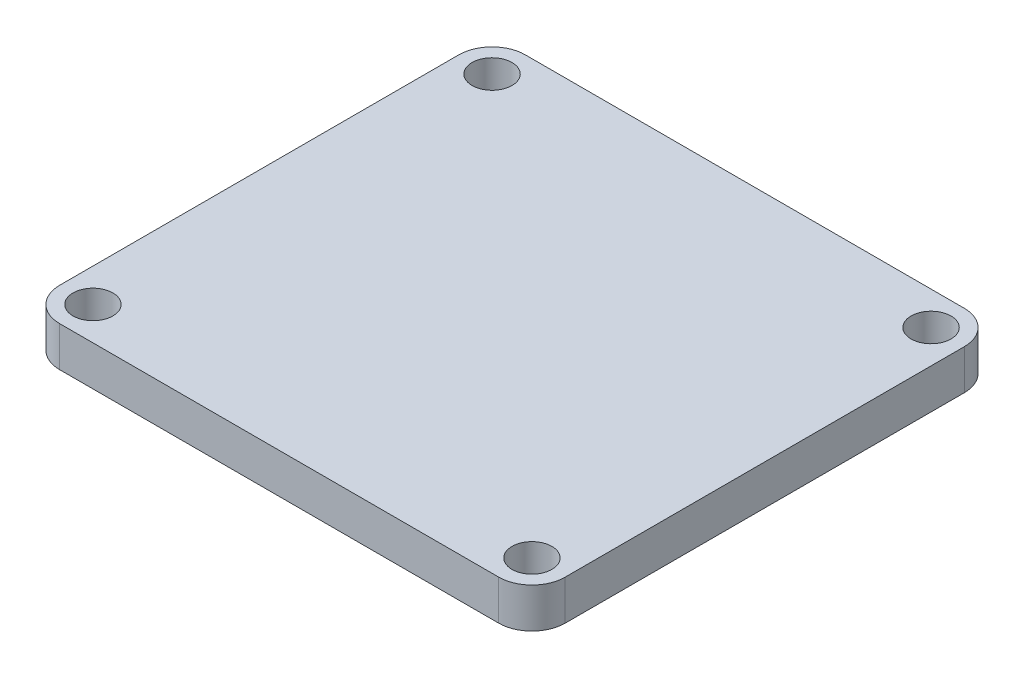
ISO-10303-21;
HEADER;
FILE_DESCRIPTION(('STEP AP214'),'2;1');
FILE_NAME('part.step','',(''),(''),'','','');
FILE_SCHEMA(('AUTOMOTIVE_DESIGN { 1 0 10303 214 1 1 1 1 }'));
ENDSEC;
DATA;
#1=APPLICATION_CONTEXT('core data for automotive mechanical design processes');
#2=APPLICATION_PROTOCOL_DEFINITION('international standard','automotive_design',2000,#1);
#3=PRODUCT_CONTEXT('',#1,'mechanical');
#4=PRODUCT('Part','Part','',(#3));
#5=PRODUCT_RELATED_PRODUCT_CATEGORY('part','',(#4));
#6=PRODUCT_DEFINITION_FORMATION('','',#4);
#7=PRODUCT_DEFINITION_CONTEXT('part definition',#1,'design');
#8=PRODUCT_DEFINITION('design','',#6,#7);
#9=PRODUCT_DEFINITION_SHAPE('','',#8);
#10=(LENGTH_UNIT() NAMED_UNIT(*) SI_UNIT(.MILLI.,.METRE.));
#11=(NAMED_UNIT(*) PLANE_ANGLE_UNIT() SI_UNIT($,.RADIAN.));
#12=(NAMED_UNIT(*) SI_UNIT($,.STERADIAN.) SOLID_ANGLE_UNIT());
#13=UNCERTAINTY_MEASURE_WITH_UNIT(LENGTH_MEASURE(1.E-05),#10,'distance_accuracy_value','');
#14=(GEOMETRIC_REPRESENTATION_CONTEXT(3) GLOBAL_UNCERTAINTY_ASSIGNED_CONTEXT((#13)) GLOBAL_UNIT_ASSIGNED_CONTEXT((#10,
#11,#12)) REPRESENTATION_CONTEXT('',''));
#15=CARTESIAN_POINT('',(0.,0.,0.));
#16=DIRECTION('',(0.,0.,1.));
#17=DIRECTION('',(1.,0.,0.));
#18=AXIS2_PLACEMENT_3D('',#15,#16,#17);
#19=CARTESIAN_POINT('',(-33.,6.,30.));
#20=DIRECTION('',(0.,-1.,0.));
#21=DIRECTION('',(0.,0.,-1.));
#22=AXIS2_PLACEMENT_3D('',#19,#20,#21);
#23=PLANE('',#22);
#24=CARTESIAN_POINT('',(-33.,6.,30.));
#25=DIRECTION('',(0.,1.,0.));
#26=DIRECTION('',(0.,0.,-1.));
#27=AXIS2_PLACEMENT_3D('',#24,#25,#26);
#28=CIRCLE('',#27,5.);
#29=CARTESIAN_POINT('',(-38.,6.,30.));
#30=VERTEX_POINT('',#29);
#31=CARTESIAN_POINT('',(-33.,6.,35.));
#32=VERTEX_POINT('',#31);
#33=EDGE_CURVE('E147',#30,#32,#28,.T.);
#34=ORIENTED_EDGE('',*,*,#33,.T.);
#35=DIRECTION('',(1.,0.,0.));
#36=VECTOR('',#35,1.);
#37=CARTESIAN_POINT('',(-33.,6.,35.));
#38=LINE('',#37,#36);
#39=CARTESIAN_POINT('',(33.,6.,35.));
#40=VERTEX_POINT('',#39);
#41=EDGE_CURVE('E95',#32,#40,#38,.T.);
#42=ORIENTED_EDGE('',*,*,#41,.T.);
#43=CARTESIAN_POINT('',(33.,6.,30.));
#44=DIRECTION('',(0.,1.,0.));
#45=DIRECTION('',(0.,0.,1.));
#46=AXIS2_PLACEMENT_3D('',#43,#44,#45);
#47=CIRCLE('',#46,5.);
#48=CARTESIAN_POINT('',(38.,6.,30.));
#49=VERTEX_POINT('',#48);
#50=EDGE_CURVE('E162',#40,#49,#47,.T.);
#51=ORIENTED_EDGE('',*,*,#50,.T.);
#52=DIRECTION('',(0.,0.,-1.));
#53=VECTOR('',#52,1.);
#54=CARTESIAN_POINT('',(38.,6.,30.));
#55=LINE('',#54,#53);
#56=CARTESIAN_POINT('',(38.,6.,-30.));
#57=VERTEX_POINT('',#56);
#58=EDGE_CURVE('E175',#49,#57,#55,.T.);
#59=ORIENTED_EDGE('',*,*,#58,.T.);
#60=CARTESIAN_POINT('',(33.,6.,-30.));
#61=DIRECTION('',(0.,1.,0.));
#62=DIRECTION('',(0.,0.,-1.));
#63=AXIS2_PLACEMENT_3D('',#60,#61,#62);
#64=CIRCLE('',#63,5.);
#65=CARTESIAN_POINT('',(33.,6.,-35.));
#66=VERTEX_POINT('',#65);
#67=EDGE_CURVE('E114',#57,#66,#64,.T.);
#68=ORIENTED_EDGE('',*,*,#67,.T.);
#69=DIRECTION('',(-1.,0.,0.));
#70=VECTOR('',#69,1.);
#71=CARTESIAN_POINT('',(-33.,6.,-35.));
#72=LINE('',#71,#70);
#73=CARTESIAN_POINT('',(-33.,6.,-35.));
#74=VERTEX_POINT('',#73);
#75=EDGE_CURVE('E108',#66,#74,#72,.T.);
#76=ORIENTED_EDGE('',*,*,#75,.T.);
#77=CARTESIAN_POINT('',(-33.,6.,-30.));
#78=DIRECTION('',(0.,1.,0.));
#79=DIRECTION('',(0.,0.,-1.));
#80=AXIS2_PLACEMENT_3D('',#77,#78,#79);
#81=CIRCLE('',#80,5.00000000000001);
#82=CARTESIAN_POINT('',(-38.,6.,-30.));
#83=VERTEX_POINT('',#82);
#84=EDGE_CURVE('E112',#74,#83,#81,.T.);
#85=ORIENTED_EDGE('',*,*,#84,.T.);
#86=DIRECTION('',(0.,0.,1.));
#87=VECTOR('',#86,1.);
#88=CARTESIAN_POINT('',(-38.,6.,30.));
#89=LINE('',#88,#87);
#90=EDGE_CURVE('E52',#83,#30,#89,.T.);
#91=ORIENTED_EDGE('',*,*,#90,.T.);
#92=EDGE_LOOP('',(#34,#42,#51,#59,#68,#76,#85,#91));
#93=FACE_BOUND('',#92,.T.);
#94=CARTESIAN_POINT('',(-33.,6.,-30.));
#95=DIRECTION('',(0.,1.,0.));
#96=DIRECTION('',(0.,0.,1.));
#97=AXIS2_PLACEMENT_3D('',#94,#95,#96);
#98=CIRCLE('',#97,3.00000000000001);
#99=CARTESIAN_POINT('',(-33.,6.,-27.));
#100=VERTEX_POINT('',#99);
#101=EDGE_CURVE('E136',#100,#100,#98,.T.);
#102=ORIENTED_EDGE('',*,*,#101,.F.);
#103=EDGE_LOOP('',(#102));
#104=FACE_BOUND('',#103,.T.);
#105=CARTESIAN_POINT('',(-33.,6.,30.));
#106=DIRECTION('',(0.,1.,0.));
#107=DIRECTION('',(0.,0.,1.));
#108=AXIS2_PLACEMENT_3D('',#105,#106,#107);
#109=CIRCLE('',#108,3.00000000000001);
#110=CARTESIAN_POINT('',(-33.,6.,33.));
#111=VERTEX_POINT('',#110);
#112=EDGE_CURVE('E184',#111,#111,#109,.T.);
#113=ORIENTED_EDGE('',*,*,#112,.F.);
#114=EDGE_LOOP('',(#113));
#115=FACE_BOUND('',#114,.T.);
#116=CARTESIAN_POINT('',(33.,6.,-30.));
#117=DIRECTION('',(0.,1.,0.));
#118=DIRECTION('',(0.,0.,1.));
#119=AXIS2_PLACEMENT_3D('',#116,#117,#118);
#120=CIRCLE('',#119,3.00000000000001);
#121=CARTESIAN_POINT('',(33.,6.,-27.));
#122=VERTEX_POINT('',#121);
#123=EDGE_CURVE('E190',#122,#122,#120,.T.);
#124=ORIENTED_EDGE('',*,*,#123,.F.);
#125=EDGE_LOOP('',(#124));
#126=FACE_BOUND('',#125,.T.);
#127=CARTESIAN_POINT('',(33.,6.,30.));
#128=DIRECTION('',(0.,1.,0.));
#129=DIRECTION('',(0.,0.,1.));
#130=AXIS2_PLACEMENT_3D('',#127,#128,#129);
#131=CIRCLE('',#130,3.00000000000001);
#132=CARTESIAN_POINT('',(33.,6.,33.));
#133=VERTEX_POINT('',#132);
#134=EDGE_CURVE('E196',#133,#133,#131,.T.);
#135=ORIENTED_EDGE('',*,*,#134,.F.);
#136=EDGE_LOOP('',(#135));
#137=FACE_BOUND('',#136,.T.);
#138=ADVANCED_FACE('F35',(#93,#104,#115,#126,#137),#23,.F.);
#139=CARTESIAN_POINT('',(-33.,0.,30.));
#140=DIRECTION('',(0.,-1.,0.));
#141=DIRECTION('',(0.,0.,-1.));
#142=AXIS2_PLACEMENT_3D('',#139,#140,#141);
#143=PLANE('',#142);
#144=CARTESIAN_POINT('',(33.,0.,-30.));
#145=DIRECTION('',(0.,1.,0.));
#146=DIRECTION('',(0.,0.,1.));
#147=AXIS2_PLACEMENT_3D('',#144,#145,#146);
#148=CIRCLE('',#147,3.00000000000001);
#149=CARTESIAN_POINT('',(33.,0.,-27.));
#150=VERTEX_POINT('',#149);
#151=EDGE_CURVE('E193',#150,#150,#148,.T.);
#152=ORIENTED_EDGE('',*,*,#151,.T.);
#153=EDGE_LOOP('',(#152));
#154=FACE_BOUND('',#153,.T.);
#155=CARTESIAN_POINT('',(-33.,0.,-30.));
#156=DIRECTION('',(0.,1.,0.));
#157=DIRECTION('',(0.,0.,1.));
#158=AXIS2_PLACEMENT_3D('',#155,#156,#157);
#159=CIRCLE('',#158,3.00000000000001);
#160=CARTESIAN_POINT('',(-33.,0.,-27.));
#161=VERTEX_POINT('',#160);
#162=EDGE_CURVE('E181',#161,#161,#159,.T.);
#163=ORIENTED_EDGE('',*,*,#162,.T.);
#164=EDGE_LOOP('',(#163));
#165=FACE_BOUND('',#164,.T.);
#166=CARTESIAN_POINT('',(-33.,0.,30.));
#167=DIRECTION('',(0.,1.,0.));
#168=DIRECTION('',(0.,0.,-1.));
#169=AXIS2_PLACEMENT_3D('',#166,#167,#168);
#170=CIRCLE('',#169,5.);
#171=CARTESIAN_POINT('',(-38.,0.,30.));
#172=VERTEX_POINT('',#171);
#173=CARTESIAN_POINT('',(-33.,0.,35.));
#174=VERTEX_POINT('',#173);
#175=EDGE_CURVE('E132',#172,#174,#170,.T.);
#176=ORIENTED_EDGE('',*,*,#175,.F.);
#177=DIRECTION('',(0.,0.,1.));
#178=VECTOR('',#177,1.);
#179=CARTESIAN_POINT('',(-38.,0.,30.));
#180=LINE('',#179,#178);
#181=CARTESIAN_POINT('',(-38.,0.,-30.));
#182=VERTEX_POINT('',#181);
#183=EDGE_CURVE('E87',#182,#172,#180,.T.);
#184=ORIENTED_EDGE('',*,*,#183,.F.);
#185=CARTESIAN_POINT('',(-33.,0.,-30.));
#186=DIRECTION('',(0.,1.,0.));
#187=DIRECTION('',(0.,0.,-1.));
#188=AXIS2_PLACEMENT_3D('',#185,#186,#187);
#189=CIRCLE('',#188,5.00000000000001);
#190=CARTESIAN_POINT('',(-33.,0.,-35.));
#191=VERTEX_POINT('',#190);
#192=EDGE_CURVE('E81',#191,#182,#189,.T.);
#193=ORIENTED_EDGE('',*,*,#192,.F.);
#194=DIRECTION('',(-1.,0.,0.));
#195=VECTOR('',#194,1.);
#196=CARTESIAN_POINT('',(-33.,0.,-35.));
#197=LINE('',#196,#195);
#198=CARTESIAN_POINT('',(33.,0.,-35.));
#199=VERTEX_POINT('',#198);
#200=EDGE_CURVE('E122',#199,#191,#197,.T.);
#201=ORIENTED_EDGE('',*,*,#200,.F.);
#202=CARTESIAN_POINT('',(33.,0.,-30.));
#203=DIRECTION('',(0.,1.,0.));
#204=DIRECTION('',(0.,0.,-1.));
#205=AXIS2_PLACEMENT_3D('',#202,#203,#204);
#206=CIRCLE('',#205,5.);
#207=CARTESIAN_POINT('',(38.,0.,-30.));
#208=VERTEX_POINT('',#207);
#209=EDGE_CURVE('E142',#208,#199,#206,.T.);
#210=ORIENTED_EDGE('',*,*,#209,.F.);
#211=DIRECTION('',(0.,0.,-1.));
#212=VECTOR('',#211,1.);
#213=CARTESIAN_POINT('',(38.,0.,30.));
#214=LINE('',#213,#212);
#215=CARTESIAN_POINT('',(38.,0.,30.));
#216=VERTEX_POINT('',#215);
#217=EDGE_CURVE('E140',#216,#208,#214,.T.);
#218=ORIENTED_EDGE('',*,*,#217,.F.);
#219=CARTESIAN_POINT('',(33.,0.,30.));
#220=DIRECTION('',(0.,1.,0.));
#221=DIRECTION('',(0.,0.,1.));
#222=AXIS2_PLACEMENT_3D('',#219,#220,#221);
#223=CIRCLE('',#222,5.);
#224=CARTESIAN_POINT('',(33.,0.,35.));
#225=VERTEX_POINT('',#224);
#226=EDGE_CURVE('E138',#225,#216,#223,.T.);
#227=ORIENTED_EDGE('',*,*,#226,.F.);
#228=DIRECTION('',(1.,0.,0.));
#229=VECTOR('',#228,1.);
#230=CARTESIAN_POINT('',(-33.,0.,35.));
#231=LINE('',#230,#229);
#232=EDGE_CURVE('E135',#174,#225,#231,.T.);
#233=ORIENTED_EDGE('',*,*,#232,.F.);
#234=EDGE_LOOP('',(#176,#184,#193,#201,#210,#218,#227,#233));
#235=FACE_BOUND('',#234,.T.);
#236=CARTESIAN_POINT('',(-33.,0.,30.));
#237=DIRECTION('',(0.,1.,0.));
#238=DIRECTION('',(0.,0.,1.));
#239=AXIS2_PLACEMENT_3D('',#236,#237,#238);
#240=CIRCLE('',#239,3.00000000000001);
#241=CARTESIAN_POINT('',(-33.,0.,33.));
#242=VERTEX_POINT('',#241);
#243=EDGE_CURVE('E187',#242,#242,#240,.T.);
#244=ORIENTED_EDGE('',*,*,#243,.T.);
#245=EDGE_LOOP('',(#244));
#246=FACE_BOUND('',#245,.T.);
#247=CARTESIAN_POINT('',(33.,0.,30.));
#248=DIRECTION('',(0.,1.,0.));
#249=DIRECTION('',(0.,0.,1.));
#250=AXIS2_PLACEMENT_3D('',#247,#248,#249);
#251=CIRCLE('',#250,3.00000000000001);
#252=CARTESIAN_POINT('',(33.,0.,33.));
#253=VERTEX_POINT('',#252);
#254=EDGE_CURVE('E199',#253,#253,#251,.T.);
#255=ORIENTED_EDGE('',*,*,#254,.T.);
#256=EDGE_LOOP('',(#255));
#257=FACE_BOUND('',#256,.T.);
#258=ADVANCED_FACE('F166',(#154,#165,#235,#246,#257),#143,.T.);
#259=CARTESIAN_POINT('',(-33.,6.,30.));
#260=DIRECTION('',(0.,-1.,0.));
#261=DIRECTION('',(0.,0.,-1.));
#262=AXIS2_PLACEMENT_3D('',#259,#260,#261);
#263=CYLINDRICAL_SURFACE('',#262,5.);
#264=ORIENTED_EDGE('',*,*,#175,.T.);
#265=DIRECTION('',(0.,-1.,0.));
#266=VECTOR('',#265,1.);
#267=CARTESIAN_POINT('',(-33.,6.,35.));
#268=LINE('',#267,#266);
#269=EDGE_CURVE('E11',#32,#174,#268,.T.);
#270=ORIENTED_EDGE('',*,*,#269,.F.);
#271=ORIENTED_EDGE('',*,*,#33,.F.);
#272=DIRECTION('',(0.,-1.,0.));
#273=VECTOR('',#272,1.);
#274=CARTESIAN_POINT('',(-38.,6.,30.));
#275=LINE('',#274,#273);
#276=EDGE_CURVE('E128',#30,#172,#275,.T.);
#277=ORIENTED_EDGE('',*,*,#276,.T.);
#278=EDGE_LOOP('',(#264,#270,#271,#277));
#279=FACE_BOUND('',#278,.T.);
#280=ADVANCED_FACE('F37',(#279),#263,.T.);
#281=CARTESIAN_POINT('',(-33.,6.,35.));
#282=DIRECTION('',(0.,0.,-1.));
#283=DIRECTION('',(-1.,0.,0.));
#284=AXIS2_PLACEMENT_3D('',#281,#282,#283);
#285=PLANE('',#284);
#286=ORIENTED_EDGE('',*,*,#232,.T.);
#287=DIRECTION('',(0.,-1.,0.));
#288=VECTOR('',#287,1.);
#289=CARTESIAN_POINT('',(33.,6.,35.));
#290=LINE('',#289,#288);
#291=EDGE_CURVE('E44',#40,#225,#290,.T.);
#292=ORIENTED_EDGE('',*,*,#291,.F.);
#293=ORIENTED_EDGE('',*,*,#41,.F.);
#294=ORIENTED_EDGE('',*,*,#269,.T.);
#295=EDGE_LOOP('',(#286,#292,#293,#294));
#296=FACE_BOUND('',#295,.T.);
#297=ADVANCED_FACE('F231',(#296),#285,.F.);
#298=CARTESIAN_POINT('',(33.,6.,30.));
#299=DIRECTION('',(0.,-1.,0.));
#300=DIRECTION('',(0.,0.,-1.));
#301=AXIS2_PLACEMENT_3D('',#298,#299,#300);
#302=CYLINDRICAL_SURFACE('',#301,5.);
#303=ORIENTED_EDGE('',*,*,#226,.T.);
#304=DIRECTION('',(0.,-1.,0.));
#305=VECTOR('',#304,1.);
#306=CARTESIAN_POINT('',(38.,6.,30.));
#307=LINE('',#306,#305);
#308=EDGE_CURVE('E154',#49,#216,#307,.T.);
#309=ORIENTED_EDGE('',*,*,#308,.F.);
#310=ORIENTED_EDGE('',*,*,#50,.F.);
#311=ORIENTED_EDGE('',*,*,#291,.T.);
#312=EDGE_LOOP('',(#303,#309,#310,#311));
#313=FACE_BOUND('',#312,.T.);
#314=ADVANCED_FACE('F160',(#313),#302,.T.);
#315=CARTESIAN_POINT('',(38.,6.,30.));
#316=DIRECTION('',(-1.,0.,0.));
#317=DIRECTION('',(0.,0.,1.));
#318=AXIS2_PLACEMENT_3D('',#315,#316,#317);
#319=PLANE('',#318);
#320=ORIENTED_EDGE('',*,*,#217,.T.);
#321=DIRECTION('',(0.,-1.,0.));
#322=VECTOR('',#321,1.);
#323=CARTESIAN_POINT('',(38.,6.,-30.));
#324=LINE('',#323,#322);
#325=EDGE_CURVE('E151',#57,#208,#324,.T.);
#326=ORIENTED_EDGE('',*,*,#325,.F.);
#327=ORIENTED_EDGE('',*,*,#58,.F.);
#328=ORIENTED_EDGE('',*,*,#308,.T.);
#329=EDGE_LOOP('',(#320,#326,#327,#328));
#330=FACE_BOUND('',#329,.T.);
#331=ADVANCED_FACE('F171',(#330),#319,.F.);
#332=CARTESIAN_POINT('',(33.,6.,-30.));
#333=DIRECTION('',(0.,-1.,0.));
#334=DIRECTION('',(0.,0.,-1.));
#335=AXIS2_PLACEMENT_3D('',#332,#333,#334);
#336=CYLINDRICAL_SURFACE('',#335,5.);
#337=ORIENTED_EDGE('',*,*,#209,.T.);
#338=DIRECTION('',(0.,-1.,0.));
#339=VECTOR('',#338,1.);
#340=CARTESIAN_POINT('',(33.,6.,-35.));
#341=LINE('',#340,#339);
#342=EDGE_CURVE('E123',#66,#199,#341,.T.);
#343=ORIENTED_EDGE('',*,*,#342,.F.);
#344=ORIENTED_EDGE('',*,*,#67,.F.);
#345=ORIENTED_EDGE('',*,*,#325,.T.);
#346=EDGE_LOOP('',(#337,#343,#344,#345));
#347=FACE_BOUND('',#346,.T.);
#348=ADVANCED_FACE('F174',(#347),#336,.T.);
#349=CARTESIAN_POINT('',(-33.,6.,-35.));
#350=DIRECTION('',(0.,0.,1.));
#351=DIRECTION('',(1.,0.,0.));
#352=AXIS2_PLACEMENT_3D('',#349,#350,#351);
#353=PLANE('',#352);
#354=ORIENTED_EDGE('',*,*,#200,.T.);
#355=DIRECTION('',(0.,-1.,0.));
#356=VECTOR('',#355,1.);
#357=CARTESIAN_POINT('',(-33.,6.,-35.));
#358=LINE('',#357,#356);
#359=EDGE_CURVE('E119',#74,#191,#358,.T.);
#360=ORIENTED_EDGE('',*,*,#359,.F.);
#361=ORIENTED_EDGE('',*,*,#75,.F.);
#362=ORIENTED_EDGE('',*,*,#342,.T.);
#363=EDGE_LOOP('',(#354,#360,#361,#362));
#364=FACE_BOUND('',#363,.T.);
#365=ADVANCED_FACE('F120',(#364),#353,.F.);
#366=CARTESIAN_POINT('',(-33.,6.,-30.));
#367=DIRECTION('',(0.,-1.,0.));
#368=DIRECTION('',(0.,0.,-1.));
#369=AXIS2_PLACEMENT_3D('',#366,#367,#368);
#370=CYLINDRICAL_SURFACE('',#369,5.00000000000001);
#371=ORIENTED_EDGE('',*,*,#192,.T.);
#372=DIRECTION('',(0.,-1.,0.));
#373=VECTOR('',#372,1.);
#374=CARTESIAN_POINT('',(-38.,6.,-30.));
#375=LINE('',#374,#373);
#376=EDGE_CURVE('E124',#83,#182,#375,.T.);
#377=ORIENTED_EDGE('',*,*,#376,.F.);
#378=ORIENTED_EDGE('',*,*,#84,.F.);
#379=ORIENTED_EDGE('',*,*,#359,.T.);
#380=EDGE_LOOP('',(#371,#377,#378,#379));
#381=FACE_BOUND('',#380,.T.);
#382=ADVANCED_FACE('F126',(#381),#370,.T.);
#383=CARTESIAN_POINT('',(-38.,6.,30.));
#384=DIRECTION('',(1.,0.,0.));
#385=DIRECTION('',(0.,0.,-1.));
#386=AXIS2_PLACEMENT_3D('',#383,#384,#385);
#387=PLANE('',#386);
#388=ORIENTED_EDGE('',*,*,#183,.T.);
#389=ORIENTED_EDGE('',*,*,#276,.F.);
#390=ORIENTED_EDGE('',*,*,#90,.F.);
#391=ORIENTED_EDGE('',*,*,#376,.T.);
#392=EDGE_LOOP('',(#388,#389,#390,#391));
#393=FACE_BOUND('',#392,.T.);
#394=ADVANCED_FACE('F219',(#393),#387,.F.);
#395=CARTESIAN_POINT('',(-33.,6.,-30.));
#396=DIRECTION('',(0.,-1.,0.));
#397=DIRECTION('',(0.,0.,-1.));
#398=AXIS2_PLACEMENT_3D('',#395,#396,#397);
#399=CYLINDRICAL_SURFACE('',#398,3.00000000000001);
#400=ORIENTED_EDGE('',*,*,#101,.T.);
#401=EDGE_LOOP('',(#400));
#402=FACE_BOUND('',#401,.T.);
#403=ORIENTED_EDGE('',*,*,#162,.F.);
#404=EDGE_LOOP('',(#403));
#405=FACE_BOUND('',#404,.T.);
#406=ADVANCED_FACE('F216',(#402,#405),#399,.F.);
#407=CARTESIAN_POINT('',(-33.,6.,30.));
#408=DIRECTION('',(0.,-1.,0.));
#409=DIRECTION('',(0.,0.,-1.));
#410=AXIS2_PLACEMENT_3D('',#407,#408,#409);
#411=CYLINDRICAL_SURFACE('',#410,3.00000000000001);
#412=ORIENTED_EDGE('',*,*,#112,.T.);
#413=EDGE_LOOP('',(#412));
#414=FACE_BOUND('',#413,.T.);
#415=ORIENTED_EDGE('',*,*,#243,.F.);
#416=EDGE_LOOP('',(#415));
#417=FACE_BOUND('',#416,.T.);
#418=ADVANCED_FACE('F295',(#414,#417),#411,.F.);
#419=CARTESIAN_POINT('',(33.,6.,-30.));
#420=DIRECTION('',(0.,-1.,0.));
#421=DIRECTION('',(0.,0.,-1.));
#422=AXIS2_PLACEMENT_3D('',#419,#420,#421);
#423=CYLINDRICAL_SURFACE('',#422,3.00000000000001);
#424=ORIENTED_EDGE('',*,*,#123,.T.);
#425=EDGE_LOOP('',(#424));
#426=FACE_BOUND('',#425,.T.);
#427=ORIENTED_EDGE('',*,*,#151,.F.);
#428=EDGE_LOOP('',(#427));
#429=FACE_BOUND('',#428,.T.);
#430=ADVANCED_FACE('F303',(#426,#429),#423,.F.);
#431=CARTESIAN_POINT('',(33.,6.,30.));
#432=DIRECTION('',(0.,-1.,0.));
#433=DIRECTION('',(0.,0.,-1.));
#434=AXIS2_PLACEMENT_3D('',#431,#432,#433);
#435=CYLINDRICAL_SURFACE('',#434,3.00000000000001);
#436=ORIENTED_EDGE('',*,*,#134,.T.);
#437=EDGE_LOOP('',(#436));
#438=FACE_BOUND('',#437,.T.);
#439=ORIENTED_EDGE('',*,*,#254,.F.);
#440=EDGE_LOOP('',(#439));
#441=FACE_BOUND('',#440,.T.);
#442=ADVANCED_FACE('F205',(#438,#441),#435,.F.);
#443=CLOSED_SHELL('',(#138,#258,#280,#297,#314,#331,#348,#365,#382,#394,#406,#418,#430,#442));
#444=MANIFOLD_SOLID_BREP('B2',#443);
#445=ADVANCED_BREP_SHAPE_REPRESENTATION('',(#18,#444),#14);
#446=SHAPE_DEFINITION_REPRESENTATION(#9,#445);
ENDSEC;
END-ISO-10303-21;
